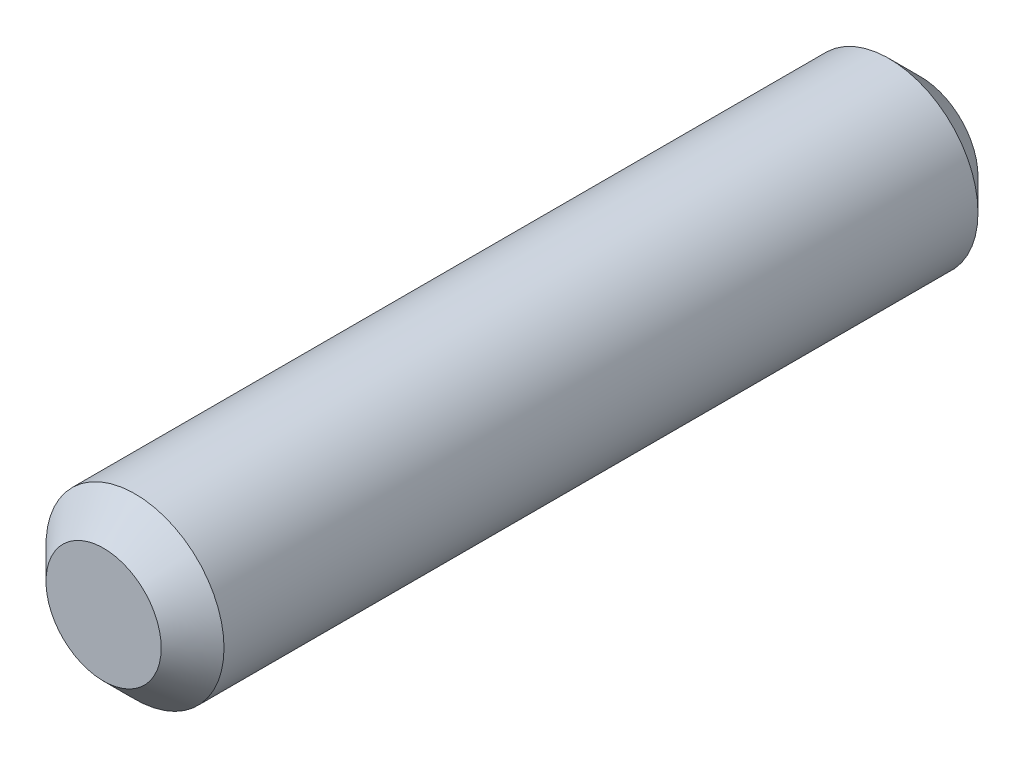
ISO-10303-21;
HEADER;
FILE_DESCRIPTION(('STEP AP214'),'2;1');
FILE_NAME('part.step','',(''),(''),'','','');
FILE_SCHEMA(('AUTOMOTIVE_DESIGN { 1 0 10303 214 1 1 1 1 }'));
ENDSEC;
DATA;
#1=APPLICATION_CONTEXT('core data for automotive mechanical design processes');
#2=APPLICATION_PROTOCOL_DEFINITION('international standard','automotive_design',2000,#1);
#3=PRODUCT_CONTEXT('',#1,'mechanical');
#4=PRODUCT('Part','Part','',(#3));
#5=PRODUCT_RELATED_PRODUCT_CATEGORY('part','',(#4));
#6=PRODUCT_DEFINITION_FORMATION('','',#4);
#7=PRODUCT_DEFINITION_CONTEXT('part definition',#1,'design');
#8=PRODUCT_DEFINITION('design','',#6,#7);
#9=PRODUCT_DEFINITION_SHAPE('','',#8);
#10=(LENGTH_UNIT() NAMED_UNIT(*) SI_UNIT(.MILLI.,.METRE.));
#11=(NAMED_UNIT(*) PLANE_ANGLE_UNIT() SI_UNIT($,.RADIAN.));
#12=(NAMED_UNIT(*) SI_UNIT($,.STERADIAN.) SOLID_ANGLE_UNIT());
#13=UNCERTAINTY_MEASURE_WITH_UNIT(LENGTH_MEASURE(1.E-05),#10,'distance_accuracy_value','');
#14=(GEOMETRIC_REPRESENTATION_CONTEXT(3) GLOBAL_UNCERTAINTY_ASSIGNED_CONTEXT((#13)) GLOBAL_UNIT_ASSIGNED_CONTEXT((#10,
#11,#12)) REPRESENTATION_CONTEXT('',''));
#15=CARTESIAN_POINT('',(0.,0.,0.));
#16=DIRECTION('',(0.,0.,1.));
#17=DIRECTION('',(1.,0.,0.));
#18=AXIS2_PLACEMENT_3D('',#15,#16,#17);
#19=CARTESIAN_POINT('',(0.,0.,39.));
#20=DIRECTION('',(0.,0.,-1.));
#21=DIRECTION('',(-1.,0.,0.));
#22=AXIS2_PLACEMENT_3D('',#19,#20,#21);
#23=CYLINDRICAL_SURFACE('',#22,8.50000000000001);
#24=CARTESIAN_POINT('',(0.,0.,-36.));
#25=DIRECTION('',(0.,0.,1.));
#26=DIRECTION('',(1.,0.,0.));
#27=AXIS2_PLACEMENT_3D('',#24,#25,#26);
#28=CIRCLE('',#27,8.50000000000001);
#29=CARTESIAN_POINT('',(8.50000000000001,0.,-36.));
#30=VERTEX_POINT('',#29);
#31=EDGE_CURVE('E29',#30,#30,#28,.T.);
#32=ORIENTED_EDGE('',*,*,#31,.T.);
#33=EDGE_LOOP('',(#32));
#34=FACE_BOUND('',#33,.T.);
#35=CARTESIAN_POINT('',(0.,0.,36.));
#36=DIRECTION('',(0.,0.,1.));
#37=DIRECTION('',(1.,0.,0.));
#38=AXIS2_PLACEMENT_3D('',#35,#36,#37);
#39=CIRCLE('',#38,8.50000000000001);
#40=CARTESIAN_POINT('',(8.50000000000001,0.,36.));
#41=VERTEX_POINT('',#40);
#42=EDGE_CURVE('E35',#41,#41,#39,.F.);
#43=ORIENTED_EDGE('',*,*,#42,.T.);
#44=EDGE_LOOP('',(#43));
#45=FACE_BOUND('',#44,.T.);
#46=ADVANCED_FACE('F14',(#34,#45),#23,.T.);
#47=CARTESIAN_POINT('',(0.,0.,39.));
#48=DIRECTION('',(0.,0.,1.));
#49=DIRECTION('',(1.,0.,0.));
#50=AXIS2_PLACEMENT_3D('',#47,#48,#49);
#51=PLANE('',#50);
#52=CARTESIAN_POINT('',(0.,0.,39.));
#53=DIRECTION('',(0.,0.,1.));
#54=DIRECTION('',(1.,0.,0.));
#55=AXIS2_PLACEMENT_3D('',#52,#53,#54);
#56=CIRCLE('',#55,5.49999999999999);
#57=CARTESIAN_POINT('',(5.49999999999999,0.,39.));
#58=VERTEX_POINT('',#57);
#59=EDGE_CURVE('E9',#58,#58,#56,.T.);
#60=ORIENTED_EDGE('',*,*,#59,.T.);
#61=EDGE_LOOP('',(#60));
#62=FACE_BOUND('',#61,.T.);
#63=ADVANCED_FACE('F54',(#62),#51,.T.);
#64=CARTESIAN_POINT('',(0.,0.,-39.));
#65=DIRECTION('',(0.,0.,1.));
#66=DIRECTION('',(1.,0.,0.));
#67=AXIS2_PLACEMENT_3D('',#64,#65,#66);
#68=PLANE('',#67);
#69=CARTESIAN_POINT('',(0.,0.,-39.));
#70=DIRECTION('',(0.,0.,1.));
#71=DIRECTION('',(1.,0.,0.));
#72=AXIS2_PLACEMENT_3D('',#69,#70,#71);
#73=CIRCLE('',#72,5.49999999999999);
#74=CARTESIAN_POINT('',(5.49999999999999,0.,-39.));
#75=VERTEX_POINT('',#74);
#76=EDGE_CURVE('E22',#75,#75,#73,.F.);
#77=ORIENTED_EDGE('',*,*,#76,.T.);
#78=EDGE_LOOP('',(#77));
#79=FACE_BOUND('',#78,.T.);
#80=ADVANCED_FACE('F51',(#79),#68,.F.);
#81=CARTESIAN_POINT('',(0.,0.,-36.));
#82=DIRECTION('',(0.,0.,1.));
#83=DIRECTION('',(1.,0.,0.));
#84=AXIS2_PLACEMENT_3D('',#81,#82,#83);
#85=CONICAL_SURFACE('',#84,8.50000000000001,0.785398163397451);
#86=ORIENTED_EDGE('',*,*,#76,.F.);
#87=EDGE_LOOP('',(#86));
#88=FACE_BOUND('',#87,.T.);
#89=ORIENTED_EDGE('',*,*,#31,.F.);
#90=EDGE_LOOP('',(#89));
#91=FACE_BOUND('',#90,.T.);
#92=ADVANCED_FACE('F46',(#88,#91),#85,.T.);
#93=CARTESIAN_POINT('',(0.,0.,39.));
#94=DIRECTION('',(0.,0.,-1.));
#95=DIRECTION('',(-1.,0.,0.));
#96=AXIS2_PLACEMENT_3D('',#93,#94,#95);
#97=CONICAL_SURFACE('',#96,5.49999999999999,0.785398163397448);
#98=ORIENTED_EDGE('',*,*,#42,.F.);
#99=EDGE_LOOP('',(#98));
#100=FACE_BOUND('',#99,.T.);
#101=ORIENTED_EDGE('',*,*,#59,.F.);
#102=EDGE_LOOP('',(#101));
#103=FACE_BOUND('',#102,.T.);
#104=ADVANCED_FACE('F16',(#100,#103),#97,.T.);
#105=CLOSED_SHELL('',(#46,#63,#80,#92,#104));
#106=MANIFOLD_SOLID_BREP('B1',#105);
#107=ADVANCED_BREP_SHAPE_REPRESENTATION('',(#18,#106),#14);
#108=SHAPE_DEFINITION_REPRESENTATION(#9,#107);
ENDSEC;
END-ISO-10303-21;
